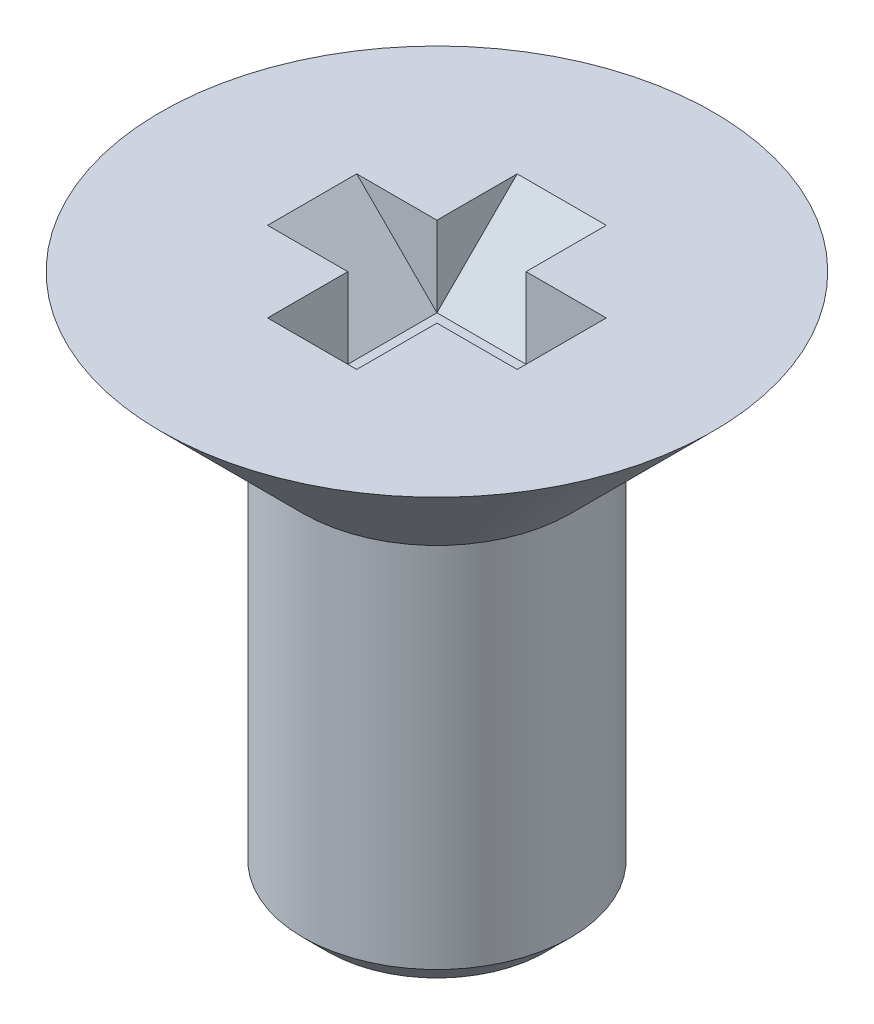
ISO-10303-21;
HEADER;
FILE_DESCRIPTION(('STEP AP214'),'2;1');
FILE_NAME('part.step','',(''),(''),'','','');
FILE_SCHEMA(('AUTOMOTIVE_DESIGN { 1 0 10303 214 1 1 1 1 }'));
ENDSEC;
DATA;
#1=APPLICATION_CONTEXT('core data for automotive mechanical design processes');
#2=APPLICATION_PROTOCOL_DEFINITION('international standard','automotive_design',2000,#1);
#3=PRODUCT_CONTEXT('',#1,'mechanical');
#4=PRODUCT('Part','Part','',(#3));
#5=PRODUCT_RELATED_PRODUCT_CATEGORY('part','',(#4));
#6=PRODUCT_DEFINITION_FORMATION('','',#4);
#7=PRODUCT_DEFINITION_CONTEXT('part definition',#1,'design');
#8=PRODUCT_DEFINITION('design','',#6,#7);
#9=PRODUCT_DEFINITION_SHAPE('','',#8);
#10=(LENGTH_UNIT() NAMED_UNIT(*) SI_UNIT(.MILLI.,.METRE.));
#11=(NAMED_UNIT(*) PLANE_ANGLE_UNIT() SI_UNIT($,.RADIAN.));
#12=(NAMED_UNIT(*) SI_UNIT($,.STERADIAN.) SOLID_ANGLE_UNIT());
#13=UNCERTAINTY_MEASURE_WITH_UNIT(LENGTH_MEASURE(1.E-05),#10,'distance_accuracy_value','');
#14=(GEOMETRIC_REPRESENTATION_CONTEXT(3) GLOBAL_UNCERTAINTY_ASSIGNED_CONTEXT((#13)) GLOBAL_UNIT_ASSIGNED_CONTEXT((#10,
#11,#12)) REPRESENTATION_CONTEXT('',''));
#15=CARTESIAN_POINT('',(0.,0.,0.));
#16=DIRECTION('',(0.,0.,1.));
#17=DIRECTION('',(1.,0.,0.));
#18=AXIS2_PLACEMENT_3D('',#15,#16,#17);
#19=CARTESIAN_POINT('',(0.,0.,0.));
#20=DIRECTION('',(0.,-1.,0.));
#21=DIRECTION('',(0.,0.,-1.));
#22=AXIS2_PLACEMENT_3D('',#19,#20,#21);
#23=PLANE('',#22);
#24=CARTESIAN_POINT('',(0.,0.,0.));
#25=DIRECTION('',(0.,1.,0.));
#26=DIRECTION('',(0.,0.,1.));
#27=AXIS2_PLACEMENT_3D('',#24,#25,#26);
#28=CIRCLE('',#27,3.10000000000002);
#29=CARTESIAN_POINT('',(0.,0.,3.10000000000002));
#30=VERTEX_POINT('',#29);
#31=EDGE_CURVE('E167',#30,#30,#28,.T.);
#32=ORIENTED_EDGE('',*,*,#31,.T.);
#33=EDGE_LOOP('',(#32));
#34=FACE_BOUND('',#33,.T.);
#35=DIRECTION('',(0.,0.,-1.));
#36=VECTOR('',#35,1.);
#37=CARTESIAN_POINT('',(-0.499999999999994,0.,-1.39999999999996));
#38=LINE('',#37,#36);
#39=CARTESIAN_POINT('',(-0.500000000000018,0.,1.39999999999998));
#40=VERTEX_POINT('',#39);
#41=CARTESIAN_POINT('',(-0.500000000000007,0.,0.500000000000039));
#42=VERTEX_POINT('',#41);
#43=EDGE_CURVE('E147',#40,#42,#38,.T.);
#44=ORIENTED_EDGE('',*,*,#43,.T.);
#45=DIRECTION('',(-1.,0.,0.));
#46=VECTOR('',#45,1.);
#47=CARTESIAN_POINT('',(-1.39999999999999,0.,0.50000000000008));
#48=LINE('',#47,#46);
#49=CARTESIAN_POINT('',(-1.39999999999999,0.,0.50000000000008));
#50=VERTEX_POINT('',#49);
#51=EDGE_CURVE('E65',#42,#50,#48,.T.);
#52=ORIENTED_EDGE('',*,*,#51,.T.);
#53=DIRECTION('',(0.,0.,1.));
#54=VECTOR('',#53,1.);
#55=CARTESIAN_POINT('',(-1.39999999999999,0.,-0.499999999999957));
#56=LINE('',#55,#54);
#57=CARTESIAN_POINT('',(-1.39999999999999,0.,-0.499999999999957));
#58=VERTEX_POINT('',#57);
#59=EDGE_CURVE('E124',#58,#50,#56,.T.);
#60=ORIENTED_EDGE('',*,*,#59,.F.);
#61=DIRECTION('',(-1.,0.,0.));
#62=VECTOR('',#61,1.);
#63=CARTESIAN_POINT('',(-1.39999999999999,0.,-0.499999999999957));
#64=LINE('',#63,#62);
#65=CARTESIAN_POINT('',(-0.500000000000004,0.,-0.49999999999995));
#66=VERTEX_POINT('',#65);
#67=EDGE_CURVE('E73',#66,#58,#64,.T.);
#68=ORIENTED_EDGE('',*,*,#67,.F.);
#69=CARTESIAN_POINT('',(-0.499999999999994,0.,-1.39999999999996));
#70=VERTEX_POINT('',#69);
#71=EDGE_CURVE('E206',#66,#70,#38,.T.);
#72=ORIENTED_EDGE('',*,*,#71,.T.);
#73=DIRECTION('',(-1.,0.,0.));
#74=VECTOR('',#73,1.);
#75=CARTESIAN_POINT('',(0.500000000000007,0.,-1.39999999999996));
#76=LINE('',#75,#74);
#77=CARTESIAN_POINT('',(0.500000000000007,0.,-1.39999999999996));
#78=VERTEX_POINT('',#77);
#79=EDGE_CURVE('E220',#78,#70,#76,.T.);
#80=ORIENTED_EDGE('',*,*,#79,.F.);
#81=DIRECTION('',(0.,0.,-1.));
#82=VECTOR('',#81,1.);
#83=CARTESIAN_POINT('',(0.500000000000007,0.,-1.39999999999996));
#84=LINE('',#83,#82);
#85=CARTESIAN_POINT('',(0.499999999999997,0.,-0.499999999999978));
#86=VERTEX_POINT('',#85);
#87=EDGE_CURVE('E209',#86,#78,#84,.T.);
#88=ORIENTED_EDGE('',*,*,#87,.F.);
#89=DIRECTION('',(1.,0.,0.));
#90=VECTOR('',#89,1.);
#91=CARTESIAN_POINT('',(1.39999999999998,0.,-0.499999999999978));
#92=LINE('',#91,#90);
#93=CARTESIAN_POINT('',(1.39999999999998,0.,-0.499999999999978));
#94=VERTEX_POINT('',#93);
#95=EDGE_CURVE('E229',#86,#94,#92,.T.);
#96=ORIENTED_EDGE('',*,*,#95,.T.);
#97=DIRECTION('',(0.,0.,-1.));
#98=VECTOR('',#97,1.);
#99=CARTESIAN_POINT('',(1.39999999999998,0.,0.5));
#100=LINE('',#99,#98);
#101=CARTESIAN_POINT('',(1.39999999999998,0.,0.5));
#102=VERTEX_POINT('',#101);
#103=EDGE_CURVE('E242',#102,#94,#100,.T.);
#104=ORIENTED_EDGE('',*,*,#103,.F.);
#105=DIRECTION('',(1.,0.,0.));
#106=VECTOR('',#105,1.);
#107=CARTESIAN_POINT('',(1.39999999999998,0.,0.5));
#108=LINE('',#107,#106);
#109=CARTESIAN_POINT('',(0.499999999999994,0.,0.500000000000059));
#110=VERTEX_POINT('',#109);
#111=EDGE_CURVE('E243',#110,#102,#108,.T.);
#112=ORIENTED_EDGE('',*,*,#111,.F.);
#113=DIRECTION('',(0.,0.,1.));
#114=VECTOR('',#113,1.);
#115=CARTESIAN_POINT('',(0.499999999999983,0.,1.4));
#116=LINE('',#115,#114);
#117=CARTESIAN_POINT('',(0.499999999999983,0.,1.4));
#118=VERTEX_POINT('',#117);
#119=EDGE_CURVE('E252',#110,#118,#116,.T.);
#120=ORIENTED_EDGE('',*,*,#119,.T.);
#121=DIRECTION('',(1.,0.,0.));
#122=VECTOR('',#121,1.);
#123=CARTESIAN_POINT('',(-0.500000000000018,0.,1.39999999999998));
#124=LINE('',#123,#122);
#125=EDGE_CURVE('E148',#40,#118,#124,.T.);
#126=ORIENTED_EDGE('',*,*,#125,.F.);
#127=EDGE_LOOP('',(#44,#52,#60,#68,#72,#80,#88,#96,#104,#112,#120,#126));
#128=FACE_BOUND('',#127,.T.);
#129=ADVANCED_FACE('F50',(#34,#128),#23,.F.);
#130=CARTESIAN_POINT('',(0.,-1.4,-0.499999999999978));
#131=DIRECTION('',(-0.707106781186551,-0.707106781186544,0.));
#132=DIRECTION('',(0.707106781186544,-0.707106781186551,0.));
#133=AXIS2_PLACEMENT_3D('',#130,#131,#132);
#134=PLANE('',#133);
#135=DIRECTION('',(0.,0.,1.));
#136=VECTOR('',#135,1.);
#137=CARTESIAN_POINT('',(-0.500000000000004,-0.899999999999998,-0.49999999999995));
#138=LINE('',#137,#136);
#139=CARTESIAN_POINT('',(-0.500000000000004,-0.899999999999995,-0.49999999999995));
#140=VERTEX_POINT('',#139);
#141=CARTESIAN_POINT('',(-0.500000000000007,-0.899999999999991,0.500000000000039));
#142=VERTEX_POINT('',#141);
#143=EDGE_CURVE('E123',#140,#142,#138,.T.);
#144=ORIENTED_EDGE('',*,*,#143,.F.);
#145=DIRECTION('',(0.707106781186544,-0.707106781186551,0.));
#146=VECTOR('',#145,1.);
#147=CARTESIAN_POINT('',(0.,-1.4,-0.499999999999978));
#148=LINE('',#147,#146);
#149=EDGE_CURVE('E161',#58,#140,#148,.T.);
#150=ORIENTED_EDGE('',*,*,#149,.F.);
#151=ORIENTED_EDGE('',*,*,#59,.T.);
#152=DIRECTION('',(0.707106781186544,-0.707106781186551,0.));
#153=VECTOR('',#152,1.);
#154=CARTESIAN_POINT('',(-2.67147415300428E-13,-1.4,0.5));
#155=LINE('',#154,#153);
#156=EDGE_CURVE('E119',#50,#142,#155,.T.);
#157=ORIENTED_EDGE('',*,*,#156,.T.);
#158=EDGE_LOOP('',(#144,#150,#151,#157));
#159=FACE_BOUND('',#158,.T.);
#160=ADVANCED_FACE('F121',(#159),#134,.F.);
#161=CARTESIAN_POINT('',(0.,0.,-0.499999999999978));
#162=DIRECTION('',(0.,0.,-1.));
#163=DIRECTION('',(-1.,0.,0.));
#164=AXIS2_PLACEMENT_3D('',#161,#162,#163);
#165=PLANE('',#164);
#166=DIRECTION('',(0.,-1.,0.));
#167=VECTOR('',#166,1.);
#168=CARTESIAN_POINT('',(-0.500000000000004,0.,-0.49999999999995));
#169=LINE('',#168,#167);
#170=EDGE_CURVE('E151',#66,#140,#169,.T.);
#171=ORIENTED_EDGE('',*,*,#170,.F.);
#172=ORIENTED_EDGE('',*,*,#67,.T.);
#173=ORIENTED_EDGE('',*,*,#149,.T.);
#174=EDGE_LOOP('',(#171,#172,#173));
#175=FACE_BOUND('',#174,.T.);
#176=ADVANCED_FACE('F195',(#175),#165,.F.);
#177=CARTESIAN_POINT('',(-2.70616862252382E-13,0.,0.5));
#178=DIRECTION('',(0.,0.,-1.));
#179=DIRECTION('',(-1.,0.,0.));
#180=AXIS2_PLACEMENT_3D('',#177,#178,#179);
#181=PLANE('',#180);
#182=ORIENTED_EDGE('',*,*,#51,.F.);
#183=DIRECTION('',(0.,-1.,0.));
#184=VECTOR('',#183,1.);
#185=CARTESIAN_POINT('',(-0.500000000000007,0.,0.500000000000039));
#186=LINE('',#185,#184);
#187=EDGE_CURVE('E127',#42,#142,#186,.T.);
#188=ORIENTED_EDGE('',*,*,#187,.T.);
#189=ORIENTED_EDGE('',*,*,#156,.F.);
#190=EDGE_LOOP('',(#182,#188,#189));
#191=FACE_BOUND('',#190,.T.);
#192=ADVANCED_FACE('F129',(#191),#181,.T.);
#193=CARTESIAN_POINT('',(0.,-1.6,0.));
#194=DIRECTION('',(0.,1.,0.));
#195=DIRECTION('',(0.,0.,1.));
#196=AXIS2_PLACEMENT_3D('',#193,#194,#195);
#197=CONICAL_SURFACE('',#196,1.5,0.785398163397453);
#198=ORIENTED_EDGE('',*,*,#31,.F.);
#199=EDGE_LOOP('',(#198));
#200=FACE_BOUND('',#199,.T.);
#201=CARTESIAN_POINT('',(0.,-1.6,0.));
#202=DIRECTION('',(0.,1.,0.));
#203=DIRECTION('',(0.,0.,1.));
#204=AXIS2_PLACEMENT_3D('',#201,#202,#203);
#205=CIRCLE('',#204,1.5);
#206=CARTESIAN_POINT('',(0.,-1.6,1.5));
#207=VERTEX_POINT('',#206);
#208=EDGE_CURVE('E164',#207,#207,#205,.T.);
#209=ORIENTED_EDGE('',*,*,#208,.T.);
#210=EDGE_LOOP('',(#209));
#211=FACE_BOUND('',#210,.T.);
#212=ADVANCED_FACE('F185',(#200,#211),#197,.T.);
#213=CARTESIAN_POINT('',(0.,0.,0.));
#214=DIRECTION('',(0.,1.,0.));
#215=DIRECTION('',(0.,0.,1.));
#216=AXIS2_PLACEMENT_3D('',#213,#214,#215);
#217=CYLINDRICAL_SURFACE('',#216,1.5);
#218=CARTESIAN_POINT('',(0.,-5.7195,0.));
#219=DIRECTION('',(0.,1.,0.));
#220=DIRECTION('',(0.,0.,1.));
#221=AXIS2_PLACEMENT_3D('',#218,#219,#220);
#222=CIRCLE('',#221,1.5);
#223=CARTESIAN_POINT('',(0.,-5.7195,1.5));
#224=VERTEX_POINT('',#223);
#225=EDGE_CURVE('E170',#224,#224,#222,.T.);
#226=ORIENTED_EDGE('',*,*,#225,.T.);
#227=EDGE_LOOP('',(#226));
#228=FACE_BOUND('',#227,.T.);
#229=ORIENTED_EDGE('',*,*,#208,.F.);
#230=EDGE_LOOP('',(#229));
#231=FACE_BOUND('',#230,.T.);
#232=ADVANCED_FACE('F182',(#228,#231),#217,.T.);
#233=CARTESIAN_POINT('',(1.5,-6.,0.));
#234=DIRECTION('',(0.,1.,0.));
#235=DIRECTION('',(0.,0.,1.));
#236=AXIS2_PLACEMENT_3D('',#233,#234,#235);
#237=PLANE('',#236);
#238=CARTESIAN_POINT('',(0.,-6.,0.));
#239=DIRECTION('',(0.,1.,0.));
#240=DIRECTION('',(0.,0.,1.));
#241=AXIS2_PLACEMENT_3D('',#238,#239,#240);
#242=CIRCLE('',#241,1.2195);
#243=CARTESIAN_POINT('',(0.,-6.,1.2195));
#244=VERTEX_POINT('',#243);
#245=EDGE_CURVE('E132',#244,#244,#242,.F.);
#246=ORIENTED_EDGE('',*,*,#245,.T.);
#247=EDGE_LOOP('',(#246));
#248=FACE_BOUND('',#247,.T.);
#249=ADVANCED_FACE('F176',(#248),#237,.F.);
#250=CARTESIAN_POINT('',(0.,-5.7195,0.));
#251=DIRECTION('',(0.,1.,0.));
#252=DIRECTION('',(0.,0.,1.));
#253=AXIS2_PLACEMENT_3D('',#250,#251,#252);
#254=CONICAL_SURFACE('',#253,1.5,0.78539816339745);
#255=ORIENTED_EDGE('',*,*,#245,.F.);
#256=EDGE_LOOP('',(#255));
#257=FACE_BOUND('',#256,.T.);
#258=ORIENTED_EDGE('',*,*,#225,.F.);
#259=EDGE_LOOP('',(#258));
#260=FACE_BOUND('',#259,.T.);
#261=ADVANCED_FACE('F52',(#257,#260),#254,.T.);
#262=CARTESIAN_POINT('',(-0.5,0.,0.));
#263=DIRECTION('',(1.,0.,0.));
#264=DIRECTION('',(0.,0.,-1.));
#265=AXIS2_PLACEMENT_3D('',#262,#263,#264);
#266=PLANE('',#265);
#267=ORIENTED_EDGE('',*,*,#43,.F.);
#268=DIRECTION('',(0.,-0.707106781186551,-0.707106781186544));
#269=VECTOR('',#268,1.);
#270=CARTESIAN_POINT('',(-0.5,-1.4,0.));
#271=LINE('',#270,#269);
#272=EDGE_CURVE('E139',#40,#142,#271,.T.);
#273=ORIENTED_EDGE('',*,*,#272,.T.);
#274=ORIENTED_EDGE('',*,*,#187,.F.);
#275=EDGE_LOOP('',(#267,#273,#274));
#276=FACE_BOUND('',#275,.T.);
#277=ADVANCED_FACE('F146',(#276),#266,.T.);
#278=CARTESIAN_POINT('',(0.5,0.,0.));
#279=DIRECTION('',(1.,0.,0.));
#280=DIRECTION('',(0.,0.,-1.));
#281=AXIS2_PLACEMENT_3D('',#278,#279,#280);
#282=PLANE('',#281);
#283=ORIENTED_EDGE('',*,*,#87,.T.);
#284=DIRECTION('',(0.,-0.707106781186551,0.707106781186544));
#285=VECTOR('',#284,1.);
#286=CARTESIAN_POINT('',(0.5,-1.4,0.));
#287=LINE('',#286,#285);
#288=CARTESIAN_POINT('',(0.499999999999997,-0.899999999999991,-0.499999999999978));
#289=VERTEX_POINT('',#288);
#290=EDGE_CURVE('E217',#78,#289,#287,.T.);
#291=ORIENTED_EDGE('',*,*,#290,.T.);
#292=DIRECTION('',(0.,-1.,0.));
#293=VECTOR('',#292,1.);
#294=CARTESIAN_POINT('',(0.499999999999997,0.,-0.499999999999978));
#295=LINE('',#294,#293);
#296=EDGE_CURVE('E155',#86,#289,#295,.T.);
#297=ORIENTED_EDGE('',*,*,#296,.F.);
#298=EDGE_LOOP('',(#283,#291,#297));
#299=FACE_BOUND('',#298,.T.);
#300=ADVANCED_FACE('F233',(#299),#282,.F.);
#301=CARTESIAN_POINT('',(-0.5,-1.4,0.));
#302=DIRECTION('',(0.,-0.707106781186544,0.707106781186551));
#303=DIRECTION('',(0.,-0.707106781186551,-0.707106781186544));
#304=AXIS2_PLACEMENT_3D('',#301,#302,#303);
#305=PLANE('',#304);
#306=DIRECTION('',(-1.,0.,0.));
#307=VECTOR('',#306,1.);
#308=CARTESIAN_POINT('',(-2.77555756156289E-13,-0.899999999999995,0.5));
#309=LINE('',#308,#307);
#310=CARTESIAN_POINT('',(0.499999999999994,-0.900000000000001,0.500000000000059));
#311=VERTEX_POINT('',#310);
#312=EDGE_CURVE('E58',#311,#142,#309,.T.);
#313=ORIENTED_EDGE('',*,*,#312,.T.);
#314=ORIENTED_EDGE('',*,*,#272,.F.);
#315=ORIENTED_EDGE('',*,*,#125,.T.);
#316=DIRECTION('',(0.,-0.707106781186551,-0.707106781186544));
#317=VECTOR('',#316,1.);
#318=CARTESIAN_POINT('',(0.5,-1.4,0.));
#319=LINE('',#318,#317);
#320=EDGE_CURVE('E142',#118,#311,#319,.T.);
#321=ORIENTED_EDGE('',*,*,#320,.T.);
#322=EDGE_LOOP('',(#313,#314,#315,#321));
#323=FACE_BOUND('',#322,.T.);
#324=ADVANCED_FACE('F138',(#323),#305,.F.);
#325=CARTESIAN_POINT('',(0.5,0.,0.));
#326=DIRECTION('',(-1.,0.,0.));
#327=DIRECTION('',(0.,0.,1.));
#328=AXIS2_PLACEMENT_3D('',#325,#326,#327);
#329=PLANE('',#328);
#330=DIRECTION('',(0.,-1.,0.));
#331=VECTOR('',#330,1.);
#332=CARTESIAN_POINT('',(0.499999999999994,0.,0.500000000000059));
#333=LINE('',#332,#331);
#334=EDGE_CURVE('E212',#110,#311,#333,.T.);
#335=ORIENTED_EDGE('',*,*,#334,.T.);
#336=ORIENTED_EDGE('',*,*,#320,.F.);
#337=ORIENTED_EDGE('',*,*,#119,.F.);
#338=EDGE_LOOP('',(#335,#336,#337));
#339=FACE_BOUND('',#338,.T.);
#340=ADVANCED_FACE('F251',(#339),#329,.T.);
#341=CARTESIAN_POINT('',(0.,0.,-0.499999999999978));
#342=DIRECTION('',(0.,0.,1.));
#343=DIRECTION('',(1.,0.,0.));
#344=AXIS2_PLACEMENT_3D('',#341,#342,#343);
#345=PLANE('',#344);
#346=ORIENTED_EDGE('',*,*,#296,.T.);
#347=DIRECTION('',(-0.707106781186544,-0.707106781186551,0.));
#348=VECTOR('',#347,1.);
#349=CARTESIAN_POINT('',(0.,-1.4,-0.499999999999978));
#350=LINE('',#349,#348);
#351=EDGE_CURVE('E227',#94,#289,#350,.T.);
#352=ORIENTED_EDGE('',*,*,#351,.F.);
#353=ORIENTED_EDGE('',*,*,#95,.F.);
#354=EDGE_LOOP('',(#346,#352,#353));
#355=FACE_BOUND('',#354,.T.);
#356=ADVANCED_FACE('F225',(#355),#345,.T.);
#357=CARTESIAN_POINT('',(-2.70616862252382E-13,0.,0.5));
#358=DIRECTION('',(0.,0.,1.));
#359=DIRECTION('',(1.,0.,0.));
#360=AXIS2_PLACEMENT_3D('',#357,#358,#359);
#361=PLANE('',#360);
#362=ORIENTED_EDGE('',*,*,#111,.T.);
#363=DIRECTION('',(-0.707106781186544,-0.707106781186551,0.));
#364=VECTOR('',#363,1.);
#365=CARTESIAN_POINT('',(-2.70616862252382E-13,-1.4,0.5));
#366=LINE('',#365,#364);
#367=EDGE_CURVE('E240',#102,#311,#366,.T.);
#368=ORIENTED_EDGE('',*,*,#367,.T.);
#369=ORIENTED_EDGE('',*,*,#334,.F.);
#370=EDGE_LOOP('',(#362,#368,#369));
#371=FACE_BOUND('',#370,.T.);
#372=ADVANCED_FACE('F255',(#371),#361,.F.);
#373=CARTESIAN_POINT('',(-2.70616862252382E-13,-1.4,0.5));
#374=DIRECTION('',(0.707106781186551,-0.707106781186544,0.));
#375=DIRECTION('',(0.707106781186544,0.707106781186551,0.));
#376=AXIS2_PLACEMENT_3D('',#373,#374,#375);
#377=PLANE('',#376);
#378=ORIENTED_EDGE('',*,*,#367,.F.);
#379=ORIENTED_EDGE('',*,*,#103,.T.);
#380=ORIENTED_EDGE('',*,*,#351,.T.);
#381=DIRECTION('',(0.,0.,-1.));
#382=VECTOR('',#381,1.);
#383=CARTESIAN_POINT('',(0.5,-0.899999999999995,0.));
#384=LINE('',#383,#382);
#385=EDGE_CURVE('E152',#311,#289,#384,.T.);
#386=ORIENTED_EDGE('',*,*,#385,.F.);
#387=EDGE_LOOP('',(#378,#379,#380,#386));
#388=FACE_BOUND('',#387,.T.);
#389=ADVANCED_FACE('F238',(#388),#377,.F.);
#390=ORIENTED_EDGE('',*,*,#170,.T.);
#391=DIRECTION('',(0.,-0.707106781186551,0.707106781186544));
#392=VECTOR('',#391,1.);
#393=CARTESIAN_POINT('',(-0.5,-1.4,0.));
#394=LINE('',#393,#392);
#395=EDGE_CURVE('E205',#70,#140,#394,.T.);
#396=ORIENTED_EDGE('',*,*,#395,.F.);
#397=ORIENTED_EDGE('',*,*,#71,.F.);
#398=EDGE_LOOP('',(#390,#396,#397));
#399=FACE_BOUND('',#398,.T.);
#400=ADVANCED_FACE('F259',(#399),#266,.T.);
#401=CARTESIAN_POINT('',(0.5,-1.4,0.));
#402=DIRECTION('',(0.,-0.707106781186544,-0.707106781186551));
#403=DIRECTION('',(0.,0.707106781186551,-0.707106781186544));
#404=AXIS2_PLACEMENT_3D('',#401,#402,#403);
#405=PLANE('',#404);
#406=DIRECTION('',(-1.,0.,0.));
#407=VECTOR('',#406,1.);
#408=CARTESIAN_POINT('',(0.,-0.899999999999995,-0.499999999999978));
#409=LINE('',#408,#407);
#410=EDGE_CURVE('E13',#289,#140,#409,.T.);
#411=ORIENTED_EDGE('',*,*,#410,.F.);
#412=ORIENTED_EDGE('',*,*,#290,.F.);
#413=ORIENTED_EDGE('',*,*,#79,.T.);
#414=ORIENTED_EDGE('',*,*,#395,.T.);
#415=EDGE_LOOP('',(#411,#412,#413,#414));
#416=FACE_BOUND('',#415,.T.);
#417=ADVANCED_FACE('F257',(#416),#405,.F.);
#418=CARTESIAN_POINT('',(0.,-0.899999999999998,0.));
#419=DIRECTION('',(0.,1.,0.));
#420=DIRECTION('',(-1.,0.,0.));
#421=AXIS2_PLACEMENT_3D('',#418,#419,#420);
#422=PLANE('',#421);
#423=ORIENTED_EDGE('',*,*,#410,.T.);
#424=ORIENTED_EDGE('',*,*,#143,.T.);
#425=ORIENTED_EDGE('',*,*,#312,.F.);
#426=ORIENTED_EDGE('',*,*,#385,.T.);
#427=EDGE_LOOP('',(#423,#424,#425,#426));
#428=FACE_BOUND('',#427,.T.);
#429=ADVANCED_FACE('F150',(#428),#422,.T.);
#430=CLOSED_SHELL('',(#129,#160,#176,#192,#212,#232,#249,#261,#277,#300,#324,#340,#356,#372,
#389,#400,#417,#429));
#431=MANIFOLD_SOLID_BREP('B2',#430);
#432=ADVANCED_BREP_SHAPE_REPRESENTATION('',(#18,#431),#14);
#433=SHAPE_DEFINITION_REPRESENTATION(#9,#432);
ENDSEC;
END-ISO-10303-21;
